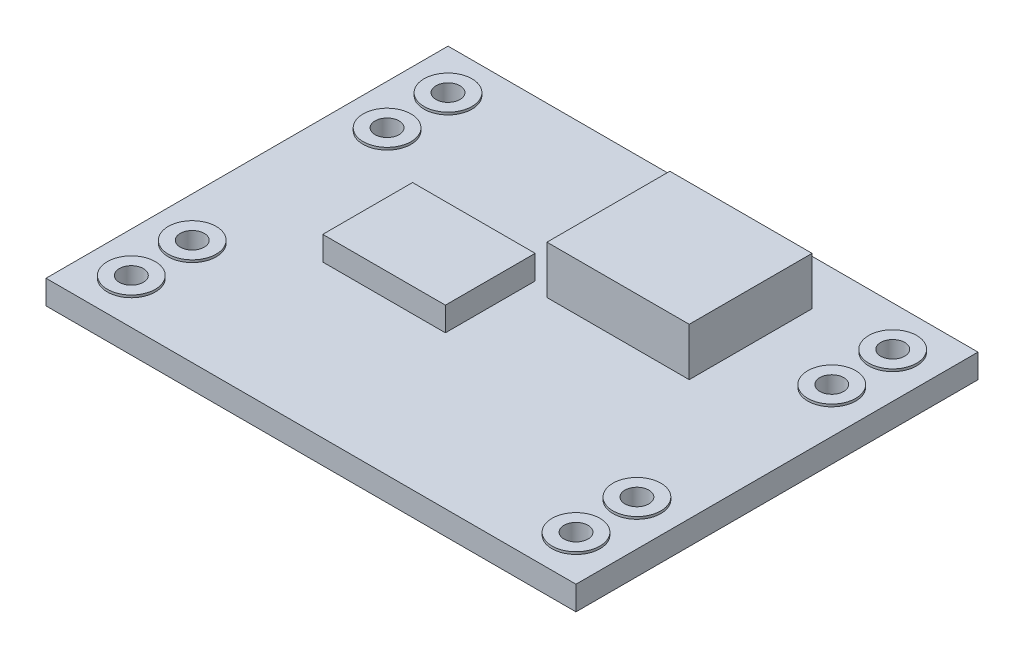
ISO-10303-21;
HEADER;
FILE_DESCRIPTION(('STEP AP214'),'2;1');
FILE_NAME('part.step','',(''),(''),'','','');
FILE_SCHEMA(('AUTOMOTIVE_DESIGN { 1 0 10303 214 1 1 1 1 }'));
ENDSEC;
DATA;
#1=APPLICATION_CONTEXT('core data for automotive mechanical design processes');
#2=APPLICATION_PROTOCOL_DEFINITION('international standard','automotive_design',2000,#1);
#3=PRODUCT_CONTEXT('',#1,'mechanical');
#4=PRODUCT('Part','Part','',(#3));
#5=PRODUCT_RELATED_PRODUCT_CATEGORY('part','',(#4));
#6=PRODUCT_DEFINITION_FORMATION('','',#4);
#7=PRODUCT_DEFINITION_CONTEXT('part definition',#1,'design');
#8=PRODUCT_DEFINITION('design','',#6,#7);
#9=PRODUCT_DEFINITION_SHAPE('','',#8);
#10=(LENGTH_UNIT() NAMED_UNIT(*) SI_UNIT(.MILLI.,.METRE.));
#11=(NAMED_UNIT(*) PLANE_ANGLE_UNIT() SI_UNIT($,.RADIAN.));
#12=(NAMED_UNIT(*) SI_UNIT($,.STERADIAN.) SOLID_ANGLE_UNIT());
#13=UNCERTAINTY_MEASURE_WITH_UNIT(LENGTH_MEASURE(1.E-05),#10,'distance_accuracy_value','');
#14=(GEOMETRIC_REPRESENTATION_CONTEXT(3) GLOBAL_UNCERTAINTY_ASSIGNED_CONTEXT((#13)) GLOBAL_UNIT_ASSIGNED_CONTEXT((#10,
#11,#12)) REPRESENTATION_CONTEXT('',''));
#15=CARTESIAN_POINT('',(0.,0.,0.));
#16=DIRECTION('',(0.,0.,1.));
#17=DIRECTION('',(1.,0.,0.));
#18=AXIS2_PLACEMENT_3D('',#15,#16,#17);
#19=CARTESIAN_POINT('',(0.,1.,0.));
#20=DIRECTION('',(0.,-1.,0.));
#21=DIRECTION('',(0.,0.,-1.));
#22=AXIS2_PLACEMENT_3D('',#19,#20,#21);
#23=PLANE('',#22);
#24=DIRECTION('',(0.,0.,-1.));
#25=VECTOR('',#24,1.);
#26=CARTESIAN_POINT('',(17.0731476416021,1.,-14.8708288067423));
#27=LINE('',#26,#25);
#28=CARTESIAN_POINT('',(17.0731476416021,1.,-9.7467736730189));
#29=VERTEX_POINT('',#28);
#30=CARTESIAN_POINT('',(17.0731476416021,1.,-14.8708288067423));
#31=VERTEX_POINT('',#30);
#32=EDGE_CURVE('E145',#29,#31,#27,.T.);
#33=ORIENTED_EDGE('',*,*,#32,.F.);
#34=DIRECTION('',(1.,0.,0.));
#35=VECTOR('',#34,1.);
#36=CARTESIAN_POINT('',(17.0731476416021,1.,-9.7467736730189));
#37=LINE('',#36,#35);
#38=CARTESIAN_POINT('',(11.1420861395846,1.,-9.7467736730189));
#39=VERTEX_POINT('',#38);
#40=EDGE_CURVE('E158',#39,#29,#37,.T.);
#41=ORIENTED_EDGE('',*,*,#40,.F.);
#42=DIRECTION('',(0.,0.,1.));
#43=VECTOR('',#42,1.);
#44=CARTESIAN_POINT('',(11.1420861395846,1.,-14.8708288067423));
#45=LINE('',#44,#43);
#46=CARTESIAN_POINT('',(11.1420861395846,1.,-14.8708288067423));
#47=VERTEX_POINT('',#46);
#48=EDGE_CURVE('E167',#47,#39,#45,.T.);
#49=ORIENTED_EDGE('',*,*,#48,.F.);
#50=DIRECTION('',(-1.,0.,0.));
#51=VECTOR('',#50,1.);
#52=CARTESIAN_POINT('',(17.0731476416021,1.,-14.8708288067423));
#53=LINE('',#52,#51);
#54=EDGE_CURVE('E148',#31,#47,#53,.T.);
#55=ORIENTED_EDGE('',*,*,#54,.F.);
#56=EDGE_LOOP('',(#33,#41,#49,#55));
#57=FACE_BOUND('',#56,.T.);
#58=CARTESIAN_POINT('',(20.32,1.,-1.78));
#59=DIRECTION('',(0.,-1.,0.));
#60=DIRECTION('',(0.,0.,-1.));
#61=AXIS2_PLACEMENT_3D('',#58,#59,#60);
#62=CIRCLE('',#61,1.);
#63=CARTESIAN_POINT('',(20.32,1.,-2.78));
#64=VERTEX_POINT('',#63);
#65=EDGE_CURVE('E234',#64,#64,#62,.T.);
#66=ORIENTED_EDGE('',*,*,#65,.T.);
#67=EDGE_LOOP('',(#66));
#68=FACE_BOUND('',#67,.T.);
#69=CARTESIAN_POINT('',(20.32,1.,-4.32));
#70=DIRECTION('',(0.,-1.,0.));
#71=DIRECTION('',(0.,0.,-1.));
#72=AXIS2_PLACEMENT_3D('',#69,#70,#71);
#73=CIRCLE('',#72,1.);
#74=CARTESIAN_POINT('',(20.32,1.,-5.32));
#75=VERTEX_POINT('',#74);
#76=EDGE_CURVE('E240',#75,#75,#73,.T.);
#77=ORIENTED_EDGE('',*,*,#76,.T.);
#78=EDGE_LOOP('',(#77));
#79=FACE_BOUND('',#78,.T.);
#80=CARTESIAN_POINT('',(1.778,1.,-4.32));
#81=DIRECTION('',(0.,-1.,0.));
#82=DIRECTION('',(0.,0.,-1.));
#83=AXIS2_PLACEMENT_3D('',#80,#81,#82);
#84=CIRCLE('',#83,1.);
#85=CARTESIAN_POINT('',(1.778,1.,-5.32));
#86=VERTEX_POINT('',#85);
#87=EDGE_CURVE('E246',#86,#86,#84,.T.);
#88=ORIENTED_EDGE('',*,*,#87,.T.);
#89=EDGE_LOOP('',(#88));
#90=FACE_BOUND('',#89,.T.);
#91=CARTESIAN_POINT('',(1.778,1.,-1.78));
#92=DIRECTION('',(0.,-1.,0.));
#93=DIRECTION('',(0.,0.,-1.));
#94=AXIS2_PLACEMENT_3D('',#91,#92,#93);
#95=CIRCLE('',#94,1.);
#96=CARTESIAN_POINT('',(1.778,1.,-2.78));
#97=VERTEX_POINT('',#96);
#98=EDGE_CURVE('E252',#97,#97,#95,.T.);
#99=ORIENTED_EDGE('',*,*,#98,.T.);
#100=EDGE_LOOP('',(#99));
#101=FACE_BOUND('',#100,.T.);
#102=CARTESIAN_POINT('',(20.32,1.,-12.444));
#103=DIRECTION('',(0.,-1.,0.));
#104=DIRECTION('',(0.,0.,-1.));
#105=AXIS2_PLACEMENT_3D('',#102,#103,#104);
#106=CIRCLE('',#105,1.);
#107=CARTESIAN_POINT('',(20.32,1.,-13.444));
#108=VERTEX_POINT('',#107);
#109=EDGE_CURVE('E258',#108,#108,#106,.T.);
#110=ORIENTED_EDGE('',*,*,#109,.T.);
#111=EDGE_LOOP('',(#110));
#112=FACE_BOUND('',#111,.T.);
#113=CARTESIAN_POINT('',(1.778,1.,-12.444));
#114=DIRECTION('',(0.,-1.,0.));
#115=DIRECTION('',(0.,0.,-1.));
#116=AXIS2_PLACEMENT_3D('',#113,#114,#115);
#117=CIRCLE('',#116,1.);
#118=CARTESIAN_POINT('',(1.778,1.,-13.444));
#119=VERTEX_POINT('',#118);
#120=EDGE_CURVE('E264',#119,#119,#117,.T.);
#121=ORIENTED_EDGE('',*,*,#120,.T.);
#122=EDGE_LOOP('',(#121));
#123=FACE_BOUND('',#122,.T.);
#124=CARTESIAN_POINT('',(20.32,1.,-14.9857925463887));
#125=DIRECTION('',(0.,-1.,0.));
#126=DIRECTION('',(0.,0.,-1.));
#127=AXIS2_PLACEMENT_3D('',#124,#125,#126);
#128=CIRCLE('',#127,1.);
#129=CARTESIAN_POINT('',(20.32,1.,-15.9857925463887));
#130=VERTEX_POINT('',#129);
#131=EDGE_CURVE('E270',#130,#130,#128,.T.);
#132=ORIENTED_EDGE('',*,*,#131,.T.);
#133=EDGE_LOOP('',(#132));
#134=FACE_BOUND('',#133,.T.);
#135=CARTESIAN_POINT('',(1.778,1.,-14.984));
#136=DIRECTION('',(0.,-1.,0.));
#137=DIRECTION('',(0.,0.,-1.));
#138=AXIS2_PLACEMENT_3D('',#135,#136,#137);
#139=CIRCLE('',#138,1.);
#140=CARTESIAN_POINT('',(1.778,1.,-15.984));
#141=VERTEX_POINT('',#140);
#142=EDGE_CURVE('E276',#141,#141,#139,.T.);
#143=ORIENTED_EDGE('',*,*,#142,.T.);
#144=EDGE_LOOP('',(#143));
#145=FACE_BOUND('',#144,.T.);
#146=DIRECTION('',(0.,0.,1.));
#147=VECTOR('',#146,1.);
#148=CARTESIAN_POINT('',(0.,1.,0.));
#149=LINE('',#148,#147);
#150=CARTESIAN_POINT('',(0.,1.,-16.764));
#151=VERTEX_POINT('',#150);
#152=CARTESIAN_POINT('',(0.,1.,0.));
#153=VERTEX_POINT('',#152);
#154=EDGE_CURVE('E280',#151,#153,#149,.T.);
#155=ORIENTED_EDGE('',*,*,#154,.T.);
#156=DIRECTION('',(1.,0.,0.));
#157=VECTOR('',#156,1.);
#158=CARTESIAN_POINT('',(0.,1.,0.));
#159=LINE('',#158,#157);
#160=CARTESIAN_POINT('',(22.098,1.,0.));
#161=VERTEX_POINT('',#160);
#162=EDGE_CURVE('E283',#153,#161,#159,.T.);
#163=ORIENTED_EDGE('',*,*,#162,.T.);
#164=DIRECTION('',(0.,0.,-1.));
#165=VECTOR('',#164,1.);
#166=CARTESIAN_POINT('',(22.098,1.,0.));
#167=LINE('',#166,#165);
#168=CARTESIAN_POINT('',(22.098,1.,-16.764));
#169=VERTEX_POINT('',#168);
#170=EDGE_CURVE('E286',#161,#169,#167,.T.);
#171=ORIENTED_EDGE('',*,*,#170,.T.);
#172=DIRECTION('',(-1.,0.,0.));
#173=VECTOR('',#172,1.);
#174=CARTESIAN_POINT('',(0.,1.,-16.764));
#175=LINE('',#174,#173);
#176=EDGE_CURVE('E288',#169,#151,#175,.T.);
#177=ORIENTED_EDGE('',*,*,#176,.T.);
#178=EDGE_LOOP('',(#155,#163,#171,#177));
#179=FACE_BOUND('',#178,.T.);
#180=DIRECTION('',(0.,0.,-1.));
#181=VECTOR('',#180,1.);
#182=CARTESIAN_POINT('',(10.2988157080376,1.,-10.0979001433139));
#183=LINE('',#182,#181);
#184=CARTESIAN_POINT('',(10.2988157080376,1.,-6.3549724269773));
#185=VERTEX_POINT('',#184);
#186=CARTESIAN_POINT('',(10.2988157080376,1.,-10.0979001433139));
#187=VERTEX_POINT('',#186);
#188=EDGE_CURVE('E144',#185,#187,#183,.T.);
#189=ORIENTED_EDGE('',*,*,#188,.F.);
#190=DIRECTION('',(1.,0.,0.));
#191=VECTOR('',#190,1.);
#192=CARTESIAN_POINT('',(10.2988157080376,1.,-6.3549724269773));
#193=LINE('',#192,#191);
#194=CARTESIAN_POINT('',(5.18597524971189,1.,-6.3549724269773));
#195=VERTEX_POINT('',#194);
#196=EDGE_CURVE('E141',#195,#185,#193,.T.);
#197=ORIENTED_EDGE('',*,*,#196,.F.);
#198=DIRECTION('',(0.,0.,1.));
#199=VECTOR('',#198,1.);
#200=CARTESIAN_POINT('',(5.18597524971189,1.,-10.0979001433139));
#201=LINE('',#200,#199);
#202=CARTESIAN_POINT('',(5.18597524971189,1.,-10.0979001433139));
#203=VERTEX_POINT('',#202);
#204=EDGE_CURVE('E55',#203,#195,#201,.T.);
#205=ORIENTED_EDGE('',*,*,#204,.F.);
#206=DIRECTION('',(-1.,0.,0.));
#207=VECTOR('',#206,1.);
#208=CARTESIAN_POINT('',(10.2988157080376,1.,-10.0979001433139));
#209=LINE('',#208,#207);
#210=EDGE_CURVE('E50',#187,#203,#209,.T.);
#211=ORIENTED_EDGE('',*,*,#210,.F.);
#212=EDGE_LOOP('',(#189,#197,#205,#211));
#213=FACE_BOUND('',#212,.T.);
#214=ADVANCED_FACE('F35',(#57,#68,#79,#90,#101,#112,#123,#134,#145,#179,#213),#23,.F.);
#215=CARTESIAN_POINT('',(0.,1.,0.));
#216=DIRECTION('',(1.,0.,0.));
#217=DIRECTION('',(0.,0.,-1.));
#218=AXIS2_PLACEMENT_3D('',#215,#216,#217);
#219=PLANE('',#218);
#220=DIRECTION('',(0.,0.,1.));
#221=VECTOR('',#220,1.);
#222=CARTESIAN_POINT('',(0.,0.,0.));
#223=LINE('',#222,#221);
#224=CARTESIAN_POINT('',(0.,0.,-16.764));
#225=VERTEX_POINT('',#224);
#226=CARTESIAN_POINT('',(0.,0.,0.));
#227=VERTEX_POINT('',#226);
#228=EDGE_CURVE('E279',#225,#227,#223,.T.);
#229=ORIENTED_EDGE('',*,*,#228,.T.);
#230=DIRECTION('',(0.,-1.,0.));
#231=VECTOR('',#230,1.);
#232=CARTESIAN_POINT('',(0.,1.,0.));
#233=LINE('',#232,#231);
#234=EDGE_CURVE('E11',#153,#227,#233,.T.);
#235=ORIENTED_EDGE('',*,*,#234,.F.);
#236=ORIENTED_EDGE('',*,*,#154,.F.);
#237=DIRECTION('',(0.,-1.,0.));
#238=VECTOR('',#237,1.);
#239=CARTESIAN_POINT('',(0.,1.,-16.764));
#240=LINE('',#239,#238);
#241=EDGE_CURVE('E290',#151,#225,#240,.T.);
#242=ORIENTED_EDGE('',*,*,#241,.T.);
#243=EDGE_LOOP('',(#229,#235,#236,#242));
#244=FACE_BOUND('',#243,.T.);
#245=ADVANCED_FACE('F37',(#244),#219,.F.);
#246=CARTESIAN_POINT('',(0.,1.,0.));
#247=DIRECTION('',(0.,0.,-1.));
#248=DIRECTION('',(-1.,0.,0.));
#249=AXIS2_PLACEMENT_3D('',#246,#247,#248);
#250=PLANE('',#249);
#251=DIRECTION('',(1.,0.,0.));
#252=VECTOR('',#251,1.);
#253=CARTESIAN_POINT('',(0.,0.,0.));
#254=LINE('',#253,#252);
#255=CARTESIAN_POINT('',(22.098,0.,0.));
#256=VERTEX_POINT('',#255);
#257=EDGE_CURVE('E293',#227,#256,#254,.T.);
#258=ORIENTED_EDGE('',*,*,#257,.T.);
#259=DIRECTION('',(0.,-1.,0.));
#260=VECTOR('',#259,1.);
#261=CARTESIAN_POINT('',(22.098,1.,0.));
#262=LINE('',#261,#260);
#263=EDGE_CURVE('E43',#161,#256,#262,.T.);
#264=ORIENTED_EDGE('',*,*,#263,.F.);
#265=ORIENTED_EDGE('',*,*,#162,.F.);
#266=ORIENTED_EDGE('',*,*,#234,.T.);
#267=EDGE_LOOP('',(#258,#264,#265,#266));
#268=FACE_BOUND('',#267,.T.);
#269=ADVANCED_FACE('F322',(#268),#250,.F.);
#270=CARTESIAN_POINT('',(22.098,1.,0.));
#271=DIRECTION('',(-1.,0.,0.));
#272=DIRECTION('',(0.,0.,1.));
#273=AXIS2_PLACEMENT_3D('',#270,#271,#272);
#274=PLANE('',#273);
#275=DIRECTION('',(0.,0.,-1.));
#276=VECTOR('',#275,1.);
#277=CARTESIAN_POINT('',(22.098,0.,0.));
#278=LINE('',#277,#276);
#279=CARTESIAN_POINT('',(22.098,0.,-16.764));
#280=VERTEX_POINT('',#279);
#281=EDGE_CURVE('E295',#256,#280,#278,.T.);
#282=ORIENTED_EDGE('',*,*,#281,.T.);
#283=DIRECTION('',(0.,-1.,0.));
#284=VECTOR('',#283,1.);
#285=CARTESIAN_POINT('',(22.098,1.,-16.764));
#286=LINE('',#285,#284);
#287=EDGE_CURVE('E300',#169,#280,#286,.T.);
#288=ORIENTED_EDGE('',*,*,#287,.F.);
#289=ORIENTED_EDGE('',*,*,#170,.F.);
#290=ORIENTED_EDGE('',*,*,#263,.T.);
#291=EDGE_LOOP('',(#282,#288,#289,#290));
#292=FACE_BOUND('',#291,.T.);
#293=ADVANCED_FACE('F307',(#292),#274,.F.);
#294=CARTESIAN_POINT('',(0.,1.,-16.764));
#295=DIRECTION('',(0.,0.,1.));
#296=DIRECTION('',(1.,0.,0.));
#297=AXIS2_PLACEMENT_3D('',#294,#295,#296);
#298=PLANE('',#297);
#299=DIRECTION('',(-1.,0.,0.));
#300=VECTOR('',#299,1.);
#301=CARTESIAN_POINT('',(0.,0.,-16.764));
#302=LINE('',#301,#300);
#303=EDGE_CURVE('E284',#280,#225,#302,.T.);
#304=ORIENTED_EDGE('',*,*,#303,.T.);
#305=ORIENTED_EDGE('',*,*,#241,.F.);
#306=ORIENTED_EDGE('',*,*,#176,.F.);
#307=ORIENTED_EDGE('',*,*,#287,.T.);
#308=EDGE_LOOP('',(#304,#305,#306,#307));
#309=FACE_BOUND('',#308,.T.);
#310=ADVANCED_FACE('F316',(#309),#298,.F.);
#311=CARTESIAN_POINT('',(0.,0.,0.));
#312=DIRECTION('',(0.,-1.,0.));
#313=DIRECTION('',(0.,0.,-1.));
#314=AXIS2_PLACEMENT_3D('',#311,#312,#313);
#315=PLANE('',#314);
#316=CARTESIAN_POINT('',(1.778,0.,-12.444));
#317=DIRECTION('',(0.,1.,0.));
#318=DIRECTION('',(0.,0.,1.));
#319=AXIS2_PLACEMENT_3D('',#316,#317,#318);
#320=CIRCLE('',#319,0.5);
#321=CARTESIAN_POINT('',(1.778,0.,-11.944));
#322=VERTEX_POINT('',#321);
#323=EDGE_CURVE('E184',#322,#322,#320,.T.);
#324=ORIENTED_EDGE('',*,*,#323,.T.);
#325=EDGE_LOOP('',(#324));
#326=FACE_BOUND('',#325,.T.);
#327=CARTESIAN_POINT('',(1.778,0.,-4.32));
#328=DIRECTION('',(0.,1.,0.));
#329=DIRECTION('',(0.,0.,1.));
#330=AXIS2_PLACEMENT_3D('',#327,#328,#329);
#331=CIRCLE('',#330,0.5);
#332=CARTESIAN_POINT('',(1.778,0.,-3.82));
#333=VERTEX_POINT('',#332);
#334=EDGE_CURVE('E191',#333,#333,#331,.T.);
#335=ORIENTED_EDGE('',*,*,#334,.T.);
#336=EDGE_LOOP('',(#335));
#337=FACE_BOUND('',#336,.T.);
#338=CARTESIAN_POINT('',(1.778,0.,-1.78));
#339=DIRECTION('',(0.,1.,0.));
#340=DIRECTION('',(0.,0.,1.));
#341=AXIS2_PLACEMENT_3D('',#338,#339,#340);
#342=CIRCLE('',#341,0.5);
#343=CARTESIAN_POINT('',(1.778,0.,-1.28));
#344=VERTEX_POINT('',#343);
#345=EDGE_CURVE('E197',#344,#344,#342,.T.);
#346=ORIENTED_EDGE('',*,*,#345,.T.);
#347=EDGE_LOOP('',(#346));
#348=FACE_BOUND('',#347,.T.);
#349=CARTESIAN_POINT('',(20.32,0.,-14.9857925463887));
#350=DIRECTION('',(0.,1.,0.));
#351=DIRECTION('',(0.,0.,1.));
#352=AXIS2_PLACEMENT_3D('',#349,#350,#351);
#353=CIRCLE('',#352,0.499999999999999);
#354=CARTESIAN_POINT('',(20.32,0.,-14.4857925463887));
#355=VERTEX_POINT('',#354);
#356=EDGE_CURVE('E203',#355,#355,#353,.T.);
#357=ORIENTED_EDGE('',*,*,#356,.T.);
#358=EDGE_LOOP('',(#357));
#359=FACE_BOUND('',#358,.T.);
#360=CARTESIAN_POINT('',(20.32,0.,-12.444));
#361=DIRECTION('',(0.,1.,0.));
#362=DIRECTION('',(0.,0.,1.));
#363=AXIS2_PLACEMENT_3D('',#360,#361,#362);
#364=CIRCLE('',#363,0.499999999999999);
#365=CARTESIAN_POINT('',(20.32,0.,-11.944));
#366=VERTEX_POINT('',#365);
#367=EDGE_CURVE('E209',#366,#366,#364,.T.);
#368=ORIENTED_EDGE('',*,*,#367,.T.);
#369=EDGE_LOOP('',(#368));
#370=FACE_BOUND('',#369,.T.);
#371=CARTESIAN_POINT('',(20.32,0.,-4.32));
#372=DIRECTION('',(0.,1.,0.));
#373=DIRECTION('',(0.,0.,1.));
#374=AXIS2_PLACEMENT_3D('',#371,#372,#373);
#375=CIRCLE('',#374,0.499999999999999);
#376=CARTESIAN_POINT('',(20.32,0.,-3.82));
#377=VERTEX_POINT('',#376);
#378=EDGE_CURVE('E215',#377,#377,#375,.T.);
#379=ORIENTED_EDGE('',*,*,#378,.T.);
#380=EDGE_LOOP('',(#379));
#381=FACE_BOUND('',#380,.T.);
#382=CARTESIAN_POINT('',(20.32,0.,-1.78));
#383=DIRECTION('',(0.,1.,0.));
#384=DIRECTION('',(0.,0.,1.));
#385=AXIS2_PLACEMENT_3D('',#382,#383,#384);
#386=CIRCLE('',#385,0.499999999999999);
#387=CARTESIAN_POINT('',(20.32,0.,-1.28));
#388=VERTEX_POINT('',#387);
#389=EDGE_CURVE('E221',#388,#388,#386,.T.);
#390=ORIENTED_EDGE('',*,*,#389,.T.);
#391=EDGE_LOOP('',(#390));
#392=FACE_BOUND('',#391,.T.);
#393=CARTESIAN_POINT('',(1.778,0.,-14.984));
#394=DIRECTION('',(0.,1.,0.));
#395=DIRECTION('',(0.,0.,1.));
#396=AXIS2_PLACEMENT_3D('',#393,#394,#395);
#397=CIRCLE('',#396,0.5);
#398=CARTESIAN_POINT('',(1.778,0.,-14.484));
#399=VERTEX_POINT('',#398);
#400=EDGE_CURVE('E226',#399,#399,#397,.T.);
#401=ORIENTED_EDGE('',*,*,#400,.T.);
#402=EDGE_LOOP('',(#401));
#403=FACE_BOUND('',#402,.T.);
#404=ORIENTED_EDGE('',*,*,#228,.F.);
#405=ORIENTED_EDGE('',*,*,#303,.F.);
#406=ORIENTED_EDGE('',*,*,#281,.F.);
#407=ORIENTED_EDGE('',*,*,#257,.F.);
#408=EDGE_LOOP('',(#404,#405,#406,#407));
#409=FACE_BOUND('',#408,.T.);
#410=ADVANCED_FACE('F313',(#326,#337,#348,#359,#370,#381,#392,#403,#409),#315,.T.);
#411=CARTESIAN_POINT('',(1.778,1.1,-14.984));
#412=DIRECTION('',(0.,-1.,0.));
#413=DIRECTION('',(0.,0.,-1.));
#414=AXIS2_PLACEMENT_3D('',#411,#412,#413);
#415=CYLINDRICAL_SURFACE('',#414,1.);
#416=CARTESIAN_POINT('',(1.778,1.1,-14.984));
#417=DIRECTION('',(0.,-1.,0.));
#418=DIRECTION('',(0.,0.,-1.));
#419=AXIS2_PLACEMENT_3D('',#416,#417,#418);
#420=CIRCLE('',#419,1.);
#421=CARTESIAN_POINT('',(1.778,1.1,-15.984));
#422=VERTEX_POINT('',#421);
#423=EDGE_CURVE('E273',#422,#422,#420,.T.);
#424=ORIENTED_EDGE('',*,*,#423,.T.);
#425=EDGE_LOOP('',(#424));
#426=FACE_BOUND('',#425,.T.);
#427=ORIENTED_EDGE('',*,*,#142,.F.);
#428=EDGE_LOOP('',(#427));
#429=FACE_BOUND('',#428,.T.);
#430=ADVANCED_FACE('F337',(#426,#429),#415,.T.);
#431=CARTESIAN_POINT('',(1.778,1.1,-14.984));
#432=DIRECTION('',(0.,-1.,0.));
#433=DIRECTION('',(0.,0.,-1.));
#434=AXIS2_PLACEMENT_3D('',#431,#432,#433);
#435=PLANE('',#434);
#436=CARTESIAN_POINT('',(1.778,1.1,-14.984));
#437=DIRECTION('',(0.,1.,0.));
#438=DIRECTION('',(0.,0.,1.));
#439=AXIS2_PLACEMENT_3D('',#436,#437,#438);
#440=CIRCLE('',#439,0.5);
#441=CARTESIAN_POINT('',(1.778,1.1,-14.484));
#442=VERTEX_POINT('',#441);
#443=EDGE_CURVE('E187',#442,#442,#440,.T.);
#444=ORIENTED_EDGE('',*,*,#443,.F.);
#445=EDGE_LOOP('',(#444));
#446=FACE_BOUND('',#445,.T.);
#447=ORIENTED_EDGE('',*,*,#423,.F.);
#448=EDGE_LOOP('',(#447));
#449=FACE_BOUND('',#448,.T.);
#450=ADVANCED_FACE('F359',(#446,#449),#435,.F.);
#451=CARTESIAN_POINT('',(20.32,1.1,-14.9857925463887));
#452=DIRECTION('',(0.,-1.,0.));
#453=DIRECTION('',(0.,0.,-1.));
#454=AXIS2_PLACEMENT_3D('',#451,#452,#453);
#455=CYLINDRICAL_SURFACE('',#454,1.);
#456=CARTESIAN_POINT('',(20.32,1.1,-14.9857925463887));
#457=DIRECTION('',(0.,-1.,0.));
#458=DIRECTION('',(0.,0.,-1.));
#459=AXIS2_PLACEMENT_3D('',#456,#457,#458);
#460=CIRCLE('',#459,1.);
#461=CARTESIAN_POINT('',(20.32,1.1,-15.9857925463887));
#462=VERTEX_POINT('',#461);
#463=EDGE_CURVE('E267',#462,#462,#460,.T.);
#464=ORIENTED_EDGE('',*,*,#463,.T.);
#465=EDGE_LOOP('',(#464));
#466=FACE_BOUND('',#465,.T.);
#467=ORIENTED_EDGE('',*,*,#131,.F.);
#468=EDGE_LOOP('',(#467));
#469=FACE_BOUND('',#468,.T.);
#470=ADVANCED_FACE('F366',(#466,#469),#455,.T.);
#471=CARTESIAN_POINT('',(20.32,1.1,-14.9857925463887));
#472=DIRECTION('',(0.,-1.,0.));
#473=DIRECTION('',(0.,0.,-1.));
#474=AXIS2_PLACEMENT_3D('',#471,#472,#473);
#475=PLANE('',#474);
#476=CARTESIAN_POINT('',(20.32,1.1,-14.9857925463887));
#477=DIRECTION('',(0.,1.,0.));
#478=DIRECTION('',(0.,0.,1.));
#479=AXIS2_PLACEMENT_3D('',#476,#477,#478);
#480=CIRCLE('',#479,0.499999999999999);
#481=CARTESIAN_POINT('',(20.32,1.1,-14.4857925463887));
#482=VERTEX_POINT('',#481);
#483=EDGE_CURVE('E206',#482,#482,#480,.T.);
#484=ORIENTED_EDGE('',*,*,#483,.F.);
#485=EDGE_LOOP('',(#484));
#486=FACE_BOUND('',#485,.T.);
#487=ORIENTED_EDGE('',*,*,#463,.F.);
#488=EDGE_LOOP('',(#487));
#489=FACE_BOUND('',#488,.T.);
#490=ADVANCED_FACE('F373',(#486,#489),#475,.F.);
#491=CARTESIAN_POINT('',(1.778,1.1,-12.444));
#492=DIRECTION('',(0.,-1.,0.));
#493=DIRECTION('',(0.,0.,-1.));
#494=AXIS2_PLACEMENT_3D('',#491,#492,#493);
#495=CYLINDRICAL_SURFACE('',#494,1.);
#496=CARTESIAN_POINT('',(1.778,1.1,-12.444));
#497=DIRECTION('',(0.,-1.,0.));
#498=DIRECTION('',(0.,0.,-1.));
#499=AXIS2_PLACEMENT_3D('',#496,#497,#498);
#500=CIRCLE('',#499,1.);
#501=CARTESIAN_POINT('',(1.778,1.1,-13.444));
#502=VERTEX_POINT('',#501);
#503=EDGE_CURVE('E261',#502,#502,#500,.T.);
#504=ORIENTED_EDGE('',*,*,#503,.T.);
#505=EDGE_LOOP('',(#504));
#506=FACE_BOUND('',#505,.T.);
#507=ORIENTED_EDGE('',*,*,#120,.F.);
#508=EDGE_LOOP('',(#507));
#509=FACE_BOUND('',#508,.T.);
#510=ADVANCED_FACE('F381',(#506,#509),#495,.T.);
#511=CARTESIAN_POINT('',(1.778,1.1,-12.444));
#512=DIRECTION('',(0.,-1.,0.));
#513=DIRECTION('',(0.,0.,-1.));
#514=AXIS2_PLACEMENT_3D('',#511,#512,#513);
#515=PLANE('',#514);
#516=CARTESIAN_POINT('',(1.778,1.1,-12.444));
#517=DIRECTION('',(0.,1.,0.));
#518=DIRECTION('',(0.,0.,1.));
#519=AXIS2_PLACEMENT_3D('',#516,#517,#518);
#520=CIRCLE('',#519,0.5);
#521=CARTESIAN_POINT('',(1.778,1.1,-11.944));
#522=VERTEX_POINT('',#521);
#523=EDGE_CURVE('E188',#522,#522,#520,.T.);
#524=ORIENTED_EDGE('',*,*,#523,.F.);
#525=EDGE_LOOP('',(#524));
#526=FACE_BOUND('',#525,.T.);
#527=ORIENTED_EDGE('',*,*,#503,.F.);
#528=EDGE_LOOP('',(#527));
#529=FACE_BOUND('',#528,.T.);
#530=ADVANCED_FACE('F389',(#526,#529),#515,.F.);
#531=CARTESIAN_POINT('',(20.32,1.1,-12.444));
#532=DIRECTION('',(0.,-1.,0.));
#533=DIRECTION('',(0.,0.,-1.));
#534=AXIS2_PLACEMENT_3D('',#531,#532,#533);
#535=CYLINDRICAL_SURFACE('',#534,1.);
#536=CARTESIAN_POINT('',(20.32,1.1,-12.444));
#537=DIRECTION('',(0.,-1.,0.));
#538=DIRECTION('',(0.,0.,-1.));
#539=AXIS2_PLACEMENT_3D('',#536,#537,#538);
#540=CIRCLE('',#539,1.);
#541=CARTESIAN_POINT('',(20.32,1.1,-13.444));
#542=VERTEX_POINT('',#541);
#543=EDGE_CURVE('E255',#542,#542,#540,.T.);
#544=ORIENTED_EDGE('',*,*,#543,.T.);
#545=EDGE_LOOP('',(#544));
#546=FACE_BOUND('',#545,.T.);
#547=ORIENTED_EDGE('',*,*,#109,.F.);
#548=EDGE_LOOP('',(#547));
#549=FACE_BOUND('',#548,.T.);
#550=ADVANCED_FACE('F397',(#546,#549),#535,.T.);
#551=CARTESIAN_POINT('',(20.32,1.1,-12.444));
#552=DIRECTION('',(0.,-1.,0.));
#553=DIRECTION('',(0.,0.,-1.));
#554=AXIS2_PLACEMENT_3D('',#551,#552,#553);
#555=PLANE('',#554);
#556=CARTESIAN_POINT('',(20.32,1.1,-12.444));
#557=DIRECTION('',(0.,1.,0.));
#558=DIRECTION('',(0.,0.,1.));
#559=AXIS2_PLACEMENT_3D('',#556,#557,#558);
#560=CIRCLE('',#559,0.499999999999999);
#561=CARTESIAN_POINT('',(20.32,1.1,-11.944));
#562=VERTEX_POINT('',#561);
#563=EDGE_CURVE('E212',#562,#562,#560,.T.);
#564=ORIENTED_EDGE('',*,*,#563,.F.);
#565=EDGE_LOOP('',(#564));
#566=FACE_BOUND('',#565,.T.);
#567=ORIENTED_EDGE('',*,*,#543,.F.);
#568=EDGE_LOOP('',(#567));
#569=FACE_BOUND('',#568,.T.);
#570=ADVANCED_FACE('F405',(#566,#569),#555,.F.);
#571=CARTESIAN_POINT('',(1.778,1.1,-1.78));
#572=DIRECTION('',(0.,-1.,0.));
#573=DIRECTION('',(0.,0.,-1.));
#574=AXIS2_PLACEMENT_3D('',#571,#572,#573);
#575=CYLINDRICAL_SURFACE('',#574,1.);
#576=CARTESIAN_POINT('',(1.778,1.1,-1.78));
#577=DIRECTION('',(0.,-1.,0.));
#578=DIRECTION('',(0.,0.,-1.));
#579=AXIS2_PLACEMENT_3D('',#576,#577,#578);
#580=CIRCLE('',#579,1.);
#581=CARTESIAN_POINT('',(1.778,1.1,-2.78));
#582=VERTEX_POINT('',#581);
#583=EDGE_CURVE('E249',#582,#582,#580,.T.);
#584=ORIENTED_EDGE('',*,*,#583,.T.);
#585=EDGE_LOOP('',(#584));
#586=FACE_BOUND('',#585,.T.);
#587=ORIENTED_EDGE('',*,*,#98,.F.);
#588=EDGE_LOOP('',(#587));
#589=FACE_BOUND('',#588,.T.);
#590=ADVANCED_FACE('F413',(#586,#589),#575,.T.);
#591=CARTESIAN_POINT('',(1.778,1.1,-1.78));
#592=DIRECTION('',(0.,-1.,0.));
#593=DIRECTION('',(0.,0.,-1.));
#594=AXIS2_PLACEMENT_3D('',#591,#592,#593);
#595=PLANE('',#594);
#596=CARTESIAN_POINT('',(1.778,1.1,-1.78));
#597=DIRECTION('',(0.,1.,0.));
#598=DIRECTION('',(0.,0.,1.));
#599=AXIS2_PLACEMENT_3D('',#596,#597,#598);
#600=CIRCLE('',#599,0.5);
#601=CARTESIAN_POINT('',(1.778,1.1,-1.28));
#602=VERTEX_POINT('',#601);
#603=EDGE_CURVE('E200',#602,#602,#600,.T.);
#604=ORIENTED_EDGE('',*,*,#603,.F.);
#605=EDGE_LOOP('',(#604));
#606=FACE_BOUND('',#605,.T.);
#607=ORIENTED_EDGE('',*,*,#583,.F.);
#608=EDGE_LOOP('',(#607));
#609=FACE_BOUND('',#608,.T.);
#610=ADVANCED_FACE('F421',(#606,#609),#595,.F.);
#611=CARTESIAN_POINT('',(1.778,1.1,-4.32));
#612=DIRECTION('',(0.,-1.,0.));
#613=DIRECTION('',(0.,0.,-1.));
#614=AXIS2_PLACEMENT_3D('',#611,#612,#613);
#615=CYLINDRICAL_SURFACE('',#614,1.);
#616=CARTESIAN_POINT('',(1.778,1.1,-4.32));
#617=DIRECTION('',(0.,-1.,0.));
#618=DIRECTION('',(0.,0.,-1.));
#619=AXIS2_PLACEMENT_3D('',#616,#617,#618);
#620=CIRCLE('',#619,1.);
#621=CARTESIAN_POINT('',(1.778,1.1,-5.32));
#622=VERTEX_POINT('',#621);
#623=EDGE_CURVE('E243',#622,#622,#620,.T.);
#624=ORIENTED_EDGE('',*,*,#623,.T.);
#625=EDGE_LOOP('',(#624));
#626=FACE_BOUND('',#625,.T.);
#627=ORIENTED_EDGE('',*,*,#87,.F.);
#628=EDGE_LOOP('',(#627));
#629=FACE_BOUND('',#628,.T.);
#630=ADVANCED_FACE('F429',(#626,#629),#615,.T.);
#631=CARTESIAN_POINT('',(1.778,1.1,-4.32));
#632=DIRECTION('',(0.,-1.,0.));
#633=DIRECTION('',(0.,0.,-1.));
#634=AXIS2_PLACEMENT_3D('',#631,#632,#633);
#635=PLANE('',#634);
#636=CARTESIAN_POINT('',(1.778,1.1,-4.32));
#637=DIRECTION('',(0.,1.,0.));
#638=DIRECTION('',(0.,0.,1.));
#639=AXIS2_PLACEMENT_3D('',#636,#637,#638);
#640=CIRCLE('',#639,0.5);
#641=CARTESIAN_POINT('',(1.778,1.1,-3.82));
#642=VERTEX_POINT('',#641);
#643=EDGE_CURVE('E194',#642,#642,#640,.T.);
#644=ORIENTED_EDGE('',*,*,#643,.F.);
#645=EDGE_LOOP('',(#644));
#646=FACE_BOUND('',#645,.T.);
#647=ORIENTED_EDGE('',*,*,#623,.F.);
#648=EDGE_LOOP('',(#647));
#649=FACE_BOUND('',#648,.T.);
#650=ADVANCED_FACE('F437',(#646,#649),#635,.F.);
#651=CARTESIAN_POINT('',(20.32,1.1,-4.32));
#652=DIRECTION('',(0.,-1.,0.));
#653=DIRECTION('',(0.,0.,-1.));
#654=AXIS2_PLACEMENT_3D('',#651,#652,#653);
#655=CYLINDRICAL_SURFACE('',#654,1.);
#656=CARTESIAN_POINT('',(20.32,1.1,-4.32));
#657=DIRECTION('',(0.,-1.,0.));
#658=DIRECTION('',(0.,0.,-1.));
#659=AXIS2_PLACEMENT_3D('',#656,#657,#658);
#660=CIRCLE('',#659,1.);
#661=CARTESIAN_POINT('',(20.32,1.1,-5.32));
#662=VERTEX_POINT('',#661);
#663=EDGE_CURVE('E237',#662,#662,#660,.T.);
#664=ORIENTED_EDGE('',*,*,#663,.T.);
#665=EDGE_LOOP('',(#664));
#666=FACE_BOUND('',#665,.T.);
#667=ORIENTED_EDGE('',*,*,#76,.F.);
#668=EDGE_LOOP('',(#667));
#669=FACE_BOUND('',#668,.T.);
#670=ADVANCED_FACE('F445',(#666,#669),#655,.T.);
#671=CARTESIAN_POINT('',(20.32,1.1,-4.32));
#672=DIRECTION('',(0.,-1.,0.));
#673=DIRECTION('',(0.,0.,-1.));
#674=AXIS2_PLACEMENT_3D('',#671,#672,#673);
#675=PLANE('',#674);
#676=CARTESIAN_POINT('',(20.32,1.1,-4.32));
#677=DIRECTION('',(0.,1.,0.));
#678=DIRECTION('',(0.,0.,1.));
#679=AXIS2_PLACEMENT_3D('',#676,#677,#678);
#680=CIRCLE('',#679,0.499999999999999);
#681=CARTESIAN_POINT('',(20.32,1.1,-3.82));
#682=VERTEX_POINT('',#681);
#683=EDGE_CURVE('E218',#682,#682,#680,.T.);
#684=ORIENTED_EDGE('',*,*,#683,.F.);
#685=EDGE_LOOP('',(#684));
#686=FACE_BOUND('',#685,.T.);
#687=ORIENTED_EDGE('',*,*,#663,.F.);
#688=EDGE_LOOP('',(#687));
#689=FACE_BOUND('',#688,.T.);
#690=ADVANCED_FACE('F453',(#686,#689),#675,.F.);
#691=CARTESIAN_POINT('',(20.32,1.1,-1.78));
#692=DIRECTION('',(0.,-1.,0.));
#693=DIRECTION('',(0.,0.,-1.));
#694=AXIS2_PLACEMENT_3D('',#691,#692,#693);
#695=CYLINDRICAL_SURFACE('',#694,1.);
#696=CARTESIAN_POINT('',(20.32,1.1,-1.78));
#697=DIRECTION('',(0.,-1.,0.));
#698=DIRECTION('',(0.,0.,-1.));
#699=AXIS2_PLACEMENT_3D('',#696,#697,#698);
#700=CIRCLE('',#699,1.);
#701=CARTESIAN_POINT('',(20.32,1.1,-2.78));
#702=VERTEX_POINT('',#701);
#703=EDGE_CURVE('E229',#702,#702,#700,.T.);
#704=ORIENTED_EDGE('',*,*,#703,.T.);
#705=EDGE_LOOP('',(#704));
#706=FACE_BOUND('',#705,.T.);
#707=ORIENTED_EDGE('',*,*,#65,.F.);
#708=EDGE_LOOP('',(#707));
#709=FACE_BOUND('',#708,.T.);
#710=ADVANCED_FACE('F460',(#706,#709),#695,.T.);
#711=CARTESIAN_POINT('',(20.32,1.1,-1.78));
#712=DIRECTION('',(0.,-1.,0.));
#713=DIRECTION('',(0.,0.,-1.));
#714=AXIS2_PLACEMENT_3D('',#711,#712,#713);
#715=PLANE('',#714);
#716=CARTESIAN_POINT('',(20.32,1.1,-1.78));
#717=DIRECTION('',(0.,1.,0.));
#718=DIRECTION('',(0.,0.,1.));
#719=AXIS2_PLACEMENT_3D('',#716,#717,#718);
#720=CIRCLE('',#719,0.499999999999999);
#721=CARTESIAN_POINT('',(20.32,1.1,-1.28));
#722=VERTEX_POINT('',#721);
#723=EDGE_CURVE('E183',#722,#722,#720,.T.);
#724=ORIENTED_EDGE('',*,*,#723,.F.);
#725=EDGE_LOOP('',(#724));
#726=FACE_BOUND('',#725,.T.);
#727=ORIENTED_EDGE('',*,*,#703,.F.);
#728=EDGE_LOOP('',(#727));
#729=FACE_BOUND('',#728,.T.);
#730=ADVANCED_FACE('F468',(#726,#729),#715,.F.);
#731=CARTESIAN_POINT('',(1.778,0.,-14.984));
#732=DIRECTION('',(0.,1.,0.));
#733=DIRECTION('',(0.,0.,1.));
#734=AXIS2_PLACEMENT_3D('',#731,#732,#733);
#735=CYLINDRICAL_SURFACE('',#734,0.5);
#736=ORIENTED_EDGE('',*,*,#400,.F.);
#737=EDGE_LOOP('',(#736));
#738=FACE_BOUND('',#737,.T.);
#739=ORIENTED_EDGE('',*,*,#443,.T.);
#740=EDGE_LOOP('',(#739));
#741=FACE_BOUND('',#740,.T.);
#742=ADVANCED_FACE('F475',(#738,#741),#735,.F.);
#743=CARTESIAN_POINT('',(20.32,0.,-1.78));
#744=DIRECTION('',(0.,1.,0.));
#745=DIRECTION('',(0.,0.,1.));
#746=AXIS2_PLACEMENT_3D('',#743,#744,#745);
#747=CYLINDRICAL_SURFACE('',#746,0.499999999999999);
#748=ORIENTED_EDGE('',*,*,#389,.F.);
#749=EDGE_LOOP('',(#748));
#750=FACE_BOUND('',#749,.T.);
#751=ORIENTED_EDGE('',*,*,#723,.T.);
#752=EDGE_LOOP('',(#751));
#753=FACE_BOUND('',#752,.T.);
#754=ADVANCED_FACE('F483',(#750,#753),#747,.F.);
#755=CARTESIAN_POINT('',(20.32,0.,-4.32));
#756=DIRECTION('',(0.,1.,0.));
#757=DIRECTION('',(0.,0.,1.));
#758=AXIS2_PLACEMENT_3D('',#755,#756,#757);
#759=CYLINDRICAL_SURFACE('',#758,0.499999999999999);
#760=ORIENTED_EDGE('',*,*,#378,.F.);
#761=EDGE_LOOP('',(#760));
#762=FACE_BOUND('',#761,.T.);
#763=ORIENTED_EDGE('',*,*,#683,.T.);
#764=EDGE_LOOP('',(#763));
#765=FACE_BOUND('',#764,.T.);
#766=ADVANCED_FACE('F491',(#762,#765),#759,.F.);
#767=CARTESIAN_POINT('',(1.778,0.,-4.32));
#768=DIRECTION('',(0.,1.,0.));
#769=DIRECTION('',(0.,0.,1.));
#770=AXIS2_PLACEMENT_3D('',#767,#768,#769);
#771=CYLINDRICAL_SURFACE('',#770,0.5);
#772=ORIENTED_EDGE('',*,*,#334,.F.);
#773=EDGE_LOOP('',(#772));
#774=FACE_BOUND('',#773,.T.);
#775=ORIENTED_EDGE('',*,*,#643,.T.);
#776=EDGE_LOOP('',(#775));
#777=FACE_BOUND('',#776,.T.);
#778=ADVANCED_FACE('F499',(#774,#777),#771,.F.);
#779=CARTESIAN_POINT('',(1.778,0.,-1.78));
#780=DIRECTION('',(0.,1.,0.));
#781=DIRECTION('',(0.,0.,1.));
#782=AXIS2_PLACEMENT_3D('',#779,#780,#781);
#783=CYLINDRICAL_SURFACE('',#782,0.5);
#784=ORIENTED_EDGE('',*,*,#345,.F.);
#785=EDGE_LOOP('',(#784));
#786=FACE_BOUND('',#785,.T.);
#787=ORIENTED_EDGE('',*,*,#603,.T.);
#788=EDGE_LOOP('',(#787));
#789=FACE_BOUND('',#788,.T.);
#790=ADVANCED_FACE('F507',(#786,#789),#783,.F.);
#791=CARTESIAN_POINT('',(20.32,0.,-12.444));
#792=DIRECTION('',(0.,1.,0.));
#793=DIRECTION('',(0.,0.,1.));
#794=AXIS2_PLACEMENT_3D('',#791,#792,#793);
#795=CYLINDRICAL_SURFACE('',#794,0.499999999999999);
#796=ORIENTED_EDGE('',*,*,#367,.F.);
#797=EDGE_LOOP('',(#796));
#798=FACE_BOUND('',#797,.T.);
#799=ORIENTED_EDGE('',*,*,#563,.T.);
#800=EDGE_LOOP('',(#799));
#801=FACE_BOUND('',#800,.T.);
#802=ADVANCED_FACE('F515',(#798,#801),#795,.F.);
#803=CARTESIAN_POINT('',(1.778,0.,-12.444));
#804=DIRECTION('',(0.,1.,0.));
#805=DIRECTION('',(0.,0.,1.));
#806=AXIS2_PLACEMENT_3D('',#803,#804,#805);
#807=CYLINDRICAL_SURFACE('',#806,0.5);
#808=ORIENTED_EDGE('',*,*,#323,.F.);
#809=EDGE_LOOP('',(#808));
#810=FACE_BOUND('',#809,.T.);
#811=ORIENTED_EDGE('',*,*,#523,.T.);
#812=EDGE_LOOP('',(#811));
#813=FACE_BOUND('',#812,.T.);
#814=ADVANCED_FACE('F523',(#810,#813),#807,.F.);
#815=CARTESIAN_POINT('',(20.32,0.,-14.9857925463887));
#816=DIRECTION('',(0.,1.,0.));
#817=DIRECTION('',(0.,0.,1.));
#818=AXIS2_PLACEMENT_3D('',#815,#816,#817);
#819=CYLINDRICAL_SURFACE('',#818,0.499999999999999);
#820=ORIENTED_EDGE('',*,*,#356,.F.);
#821=EDGE_LOOP('',(#820));
#822=FACE_BOUND('',#821,.T.);
#823=ORIENTED_EDGE('',*,*,#483,.T.);
#824=EDGE_LOOP('',(#823));
#825=FACE_BOUND('',#824,.T.);
#826=ADVANCED_FACE('F531',(#822,#825),#819,.F.);
#827=CARTESIAN_POINT('',(17.0731476416021,3.,-14.8708288067423));
#828=DIRECTION('',(-1.,0.,0.));
#829=DIRECTION('',(0.,0.,1.));
#830=AXIS2_PLACEMENT_3D('',#827,#828,#829);
#831=PLANE('',#830);
#832=ORIENTED_EDGE('',*,*,#32,.T.);
#833=DIRECTION('',(0.,-1.,0.));
#834=VECTOR('',#833,1.);
#835=CARTESIAN_POINT('',(17.0731476416021,3.,-14.8708288067423));
#836=LINE('',#835,#834);
#837=CARTESIAN_POINT('',(17.0731476416021,3.,-14.8708288067423));
#838=VERTEX_POINT('',#837);
#839=EDGE_CURVE('E180',#838,#31,#836,.T.);
#840=ORIENTED_EDGE('',*,*,#839,.F.);
#841=DIRECTION('',(0.,0.,-1.));
#842=VECTOR('',#841,1.);
#843=CARTESIAN_POINT('',(17.0731476416021,3.,-14.8708288067423));
#844=LINE('',#843,#842);
#845=CARTESIAN_POINT('',(17.0731476416021,3.,-9.7467736730189));
#846=VERTEX_POINT('',#845);
#847=EDGE_CURVE('E154',#846,#838,#844,.T.);
#848=ORIENTED_EDGE('',*,*,#847,.F.);
#849=DIRECTION('',(0.,-1.,0.));
#850=VECTOR('',#849,1.);
#851=CARTESIAN_POINT('',(17.0731476416021,3.,-9.7467736730189));
#852=LINE('',#851,#850);
#853=EDGE_CURVE('E163',#846,#29,#852,.T.);
#854=ORIENTED_EDGE('',*,*,#853,.T.);
#855=EDGE_LOOP('',(#832,#840,#848,#854));
#856=FACE_BOUND('',#855,.T.);
#857=ADVANCED_FACE('F539',(#856),#831,.F.);
#858=CARTESIAN_POINT('',(17.0731476416021,3.,-14.8708288067423));
#859=DIRECTION('',(0.,0.,1.));
#860=DIRECTION('',(1.,0.,0.));
#861=AXIS2_PLACEMENT_3D('',#858,#859,#860);
#862=PLANE('',#861);
#863=ORIENTED_EDGE('',*,*,#54,.T.);
#864=DIRECTION('',(0.,-1.,0.));
#865=VECTOR('',#864,1.);
#866=CARTESIAN_POINT('',(11.1420861395846,3.,-14.8708288067423));
#867=LINE('',#866,#865);
#868=CARTESIAN_POINT('',(11.1420861395846,3.,-14.8708288067423));
#869=VERTEX_POINT('',#868);
#870=EDGE_CURVE('E177',#869,#47,#867,.T.);
#871=ORIENTED_EDGE('',*,*,#870,.F.);
#872=DIRECTION('',(-1.,0.,0.));
#873=VECTOR('',#872,1.);
#874=CARTESIAN_POINT('',(17.0731476416021,3.,-14.8708288067423));
#875=LINE('',#874,#873);
#876=EDGE_CURVE('E157',#838,#869,#875,.T.);
#877=ORIENTED_EDGE('',*,*,#876,.F.);
#878=ORIENTED_EDGE('',*,*,#839,.T.);
#879=EDGE_LOOP('',(#863,#871,#877,#878));
#880=FACE_BOUND('',#879,.T.);
#881=ADVANCED_FACE('F547',(#880),#862,.F.);
#882=CARTESIAN_POINT('',(11.1420861395846,3.,-14.8708288067423));
#883=DIRECTION('',(1.,0.,0.));
#884=DIRECTION('',(0.,0.,-1.));
#885=AXIS2_PLACEMENT_3D('',#882,#883,#884);
#886=PLANE('',#885);
#887=ORIENTED_EDGE('',*,*,#48,.T.);
#888=DIRECTION('',(0.,-1.,0.));
#889=VECTOR('',#888,1.);
#890=CARTESIAN_POINT('',(11.1420861395846,3.,-9.7467736730189));
#891=LINE('',#890,#889);
#892=CARTESIAN_POINT('',(11.1420861395846,3.,-9.7467736730189));
#893=VERTEX_POINT('',#892);
#894=EDGE_CURVE('E174',#893,#39,#891,.T.);
#895=ORIENTED_EDGE('',*,*,#894,.F.);
#896=DIRECTION('',(0.,0.,1.));
#897=VECTOR('',#896,1.);
#898=CARTESIAN_POINT('',(11.1420861395846,3.,-14.8708288067423));
#899=LINE('',#898,#897);
#900=EDGE_CURVE('E160',#869,#893,#899,.T.);
#901=ORIENTED_EDGE('',*,*,#900,.F.);
#902=ORIENTED_EDGE('',*,*,#870,.T.);
#903=EDGE_LOOP('',(#887,#895,#901,#902));
#904=FACE_BOUND('',#903,.T.);
#905=ADVANCED_FACE('F555',(#904),#886,.F.);
#906=CARTESIAN_POINT('',(17.0731476416021,3.,-9.7467736730189));
#907=DIRECTION('',(0.,0.,-1.));
#908=DIRECTION('',(-1.,0.,0.));
#909=AXIS2_PLACEMENT_3D('',#906,#907,#908);
#910=PLANE('',#909);
#911=ORIENTED_EDGE('',*,*,#40,.T.);
#912=ORIENTED_EDGE('',*,*,#853,.F.);
#913=DIRECTION('',(1.,0.,0.));
#914=VECTOR('',#913,1.);
#915=CARTESIAN_POINT('',(17.0731476416021,3.,-9.7467736730189));
#916=LINE('',#915,#914);
#917=EDGE_CURVE('E162',#893,#846,#916,.T.);
#918=ORIENTED_EDGE('',*,*,#917,.F.);
#919=ORIENTED_EDGE('',*,*,#894,.T.);
#920=EDGE_LOOP('',(#911,#912,#918,#919));
#921=FACE_BOUND('',#920,.T.);
#922=ADVANCED_FACE('F563',(#921),#910,.F.);
#923=CARTESIAN_POINT('',(0.,3.,0.));
#924=DIRECTION('',(0.,-1.,0.));
#925=DIRECTION('',(0.,0.,-1.));
#926=AXIS2_PLACEMENT_3D('',#923,#924,#925);
#927=PLANE('',#926);
#928=ORIENTED_EDGE('',*,*,#847,.T.);
#929=ORIENTED_EDGE('',*,*,#876,.T.);
#930=ORIENTED_EDGE('',*,*,#900,.T.);
#931=ORIENTED_EDGE('',*,*,#917,.T.);
#932=EDGE_LOOP('',(#928,#929,#930,#931));
#933=FACE_BOUND('',#932,.T.);
#934=ADVANCED_FACE('F571',(#933),#927,.F.);
#935=CARTESIAN_POINT('',(10.2988157080376,2.,-10.0979001433139));
#936=DIRECTION('',(-1.,0.,0.));
#937=DIRECTION('',(0.,0.,1.));
#938=AXIS2_PLACEMENT_3D('',#935,#936,#937);
#939=PLANE('',#938);
#940=ORIENTED_EDGE('',*,*,#188,.T.);
#941=DIRECTION('',(0.,-1.,0.));
#942=VECTOR('',#941,1.);
#943=CARTESIAN_POINT('',(10.2988157080376,2.,-10.0979001433139));
#944=LINE('',#943,#942);
#945=CARTESIAN_POINT('',(10.2988157080376,2.,-10.0979001433139));
#946=VERTEX_POINT('',#945);
#947=EDGE_CURVE('E125',#946,#187,#944,.T.);
#948=ORIENTED_EDGE('',*,*,#947,.F.);
#949=DIRECTION('',(0.,0.,-1.));
#950=VECTOR('',#949,1.);
#951=CARTESIAN_POINT('',(10.2988157080376,2.,-10.0979001433139));
#952=LINE('',#951,#950);
#953=CARTESIAN_POINT('',(10.2988157080376,2.,-6.3549724269773));
#954=VERTEX_POINT('',#953);
#955=EDGE_CURVE('E132',#954,#946,#952,.T.);
#956=ORIENTED_EDGE('',*,*,#955,.F.);
#957=DIRECTION('',(0.,-1.,0.));
#958=VECTOR('',#957,1.);
#959=CARTESIAN_POINT('',(10.2988157080376,2.,-6.3549724269773));
#960=LINE('',#959,#958);
#961=EDGE_CURVE('E708',#954,#185,#960,.T.);
#962=ORIENTED_EDGE('',*,*,#961,.T.);
#963=EDGE_LOOP('',(#940,#948,#956,#962));
#964=FACE_BOUND('',#963,.T.);
#965=ADVANCED_FACE('F143',(#964),#939,.F.);
#966=CARTESIAN_POINT('',(10.2988157080376,2.,-10.0979001433139));
#967=DIRECTION('',(0.,0.,1.));
#968=DIRECTION('',(1.,0.,0.));
#969=AXIS2_PLACEMENT_3D('',#966,#967,#968);
#970=PLANE('',#969);
#971=ORIENTED_EDGE('',*,*,#210,.T.);
#972=DIRECTION('',(0.,-1.,0.));
#973=VECTOR('',#972,1.);
#974=CARTESIAN_POINT('',(5.18597524971189,2.,-10.0979001433139));
#975=LINE('',#974,#973);
#976=CARTESIAN_POINT('',(5.18597524971189,2.,-10.0979001433139));
#977=VERTEX_POINT('',#976);
#978=EDGE_CURVE('E128',#977,#203,#975,.T.);
#979=ORIENTED_EDGE('',*,*,#978,.F.);
#980=DIRECTION('',(-1.,0.,0.));
#981=VECTOR('',#980,1.);
#982=CARTESIAN_POINT('',(10.2988157080376,2.,-10.0979001433139));
#983=LINE('',#982,#981);
#984=EDGE_CURVE('E121',#946,#977,#983,.T.);
#985=ORIENTED_EDGE('',*,*,#984,.F.);
#986=ORIENTED_EDGE('',*,*,#947,.T.);
#987=EDGE_LOOP('',(#971,#979,#985,#986));
#988=FACE_BOUND('',#987,.T.);
#989=ADVANCED_FACE('F123',(#988),#970,.F.);
#990=CARTESIAN_POINT('',(5.18597524971189,2.,-10.0979001433139));
#991=DIRECTION('',(1.,0.,0.));
#992=DIRECTION('',(0.,0.,-1.));
#993=AXIS2_PLACEMENT_3D('',#990,#991,#992);
#994=PLANE('',#993);
#995=ORIENTED_EDGE('',*,*,#204,.T.);
#996=DIRECTION('',(0.,-1.,0.));
#997=VECTOR('',#996,1.);
#998=CARTESIAN_POINT('',(5.18597524971189,2.,-6.3549724269773));
#999=LINE('',#998,#997);
#1000=CARTESIAN_POINT('',(5.18597524971189,2.,-6.3549724269773));
#1001=VERTEX_POINT('',#1000);
#1002=EDGE_CURVE('E150',#1001,#195,#999,.T.);
#1003=ORIENTED_EDGE('',*,*,#1002,.F.);
#1004=DIRECTION('',(0.,0.,1.));
#1005=VECTOR('',#1004,1.);
#1006=CARTESIAN_POINT('',(5.18597524971189,2.,-10.0979001433139));
#1007=LINE('',#1006,#1005);
#1008=EDGE_CURVE('E131',#977,#1001,#1007,.T.);
#1009=ORIENTED_EDGE('',*,*,#1008,.F.);
#1010=ORIENTED_EDGE('',*,*,#978,.T.);
#1011=EDGE_LOOP('',(#995,#1003,#1009,#1010));
#1012=FACE_BOUND('',#1011,.T.);
#1013=ADVANCED_FACE('F592',(#1012),#994,.F.);
#1014=CARTESIAN_POINT('',(10.2988157080376,2.,-6.3549724269773));
#1015=DIRECTION('',(0.,0.,-1.));
#1016=DIRECTION('',(-1.,0.,0.));
#1017=AXIS2_PLACEMENT_3D('',#1014,#1015,#1016);
#1018=PLANE('',#1017);
#1019=ORIENTED_EDGE('',*,*,#196,.T.);
#1020=ORIENTED_EDGE('',*,*,#961,.F.);
#1021=DIRECTION('',(1.,0.,0.));
#1022=VECTOR('',#1021,1.);
#1023=CARTESIAN_POINT('',(10.2988157080376,2.,-6.3549724269773));
#1024=LINE('',#1023,#1022);
#1025=EDGE_CURVE('E137',#1001,#954,#1024,.T.);
#1026=ORIENTED_EDGE('',*,*,#1025,.F.);
#1027=ORIENTED_EDGE('',*,*,#1002,.T.);
#1028=EDGE_LOOP('',(#1019,#1020,#1026,#1027));
#1029=FACE_BOUND('',#1028,.T.);
#1030=ADVANCED_FACE('F599',(#1029),#1018,.F.);
#1031=CARTESIAN_POINT('',(0.,2.,0.));
#1032=DIRECTION('',(0.,-1.,0.));
#1033=DIRECTION('',(0.,0.,-1.));
#1034=AXIS2_PLACEMENT_3D('',#1031,#1032,#1033);
#1035=PLANE('',#1034);
#1036=ORIENTED_EDGE('',*,*,#955,.T.);
#1037=ORIENTED_EDGE('',*,*,#984,.T.);
#1038=ORIENTED_EDGE('',*,*,#1008,.T.);
#1039=ORIENTED_EDGE('',*,*,#1025,.T.);
#1040=EDGE_LOOP('',(#1036,#1037,#1038,#1039));
#1041=FACE_BOUND('',#1040,.T.);
#1042=ADVANCED_FACE('F135',(#1041),#1035,.F.);
#1043=CLOSED_SHELL('',(#214,#245,#269,#293,#310,#410,#430,#450,#470,#490,#510,#530,#550,#570,
#590,#610,#630,#650,#670,#690,#710,#730,#742,#754,#766,#778,#790,#802,#814,#826,#857,#881,#905,
#922,#934,#965,#989,#1013,#1030,#1042));
#1044=MANIFOLD_SOLID_BREP('B2',#1043);
#1045=ADVANCED_BREP_SHAPE_REPRESENTATION('',(#18,#1044),#14);
#1046=SHAPE_DEFINITION_REPRESENTATION(#9,#1045);
ENDSEC;
END-ISO-10303-21;
